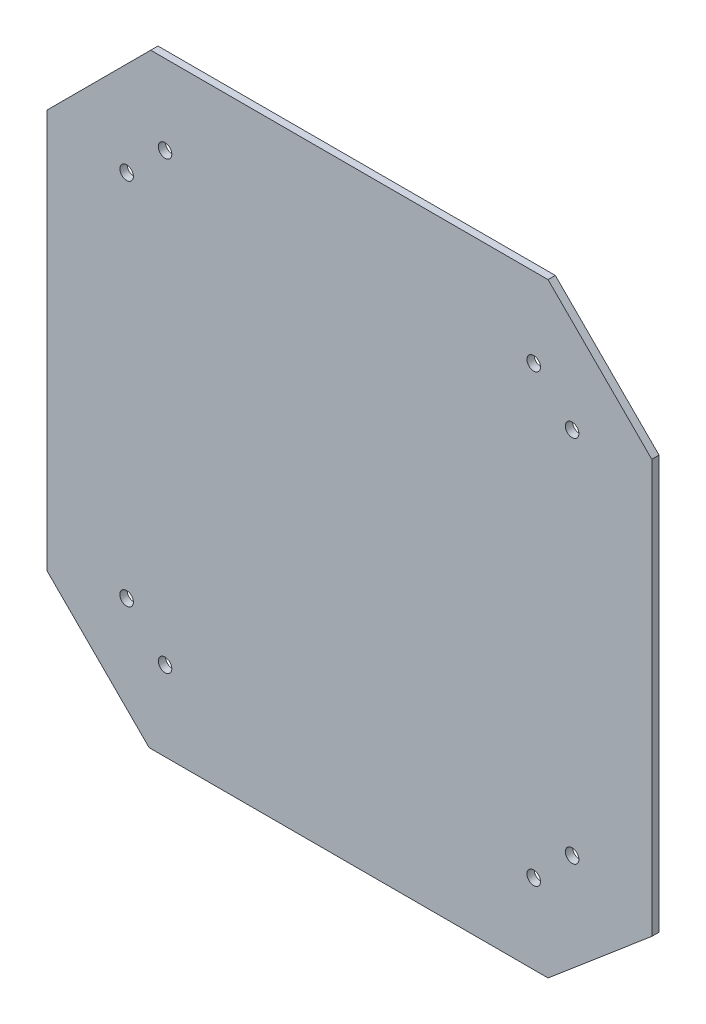
ISO-10303-21;
HEADER;
FILE_DESCRIPTION(('STEP AP214'),'2;1');
FILE_NAME('part.step','',(''),(''),'','','');
FILE_SCHEMA(('AUTOMOTIVE_DESIGN { 1 0 10303 214 1 1 1 1 }'));
ENDSEC;
DATA;
#1=APPLICATION_CONTEXT('core data for automotive mechanical design processes');
#2=APPLICATION_PROTOCOL_DEFINITION('international standard','automotive_design',2000,#1);
#3=PRODUCT_CONTEXT('',#1,'mechanical');
#4=PRODUCT('Part','Part','',(#3));
#5=PRODUCT_RELATED_PRODUCT_CATEGORY('part','',(#4));
#6=PRODUCT_DEFINITION_FORMATION('','',#4);
#7=PRODUCT_DEFINITION_CONTEXT('part definition',#1,'design');
#8=PRODUCT_DEFINITION('design','',#6,#7);
#9=PRODUCT_DEFINITION_SHAPE('','',#8);
#10=(LENGTH_UNIT() NAMED_UNIT(*) SI_UNIT(.MILLI.,.METRE.));
#11=(NAMED_UNIT(*) PLANE_ANGLE_UNIT() SI_UNIT($,.RADIAN.));
#12=(NAMED_UNIT(*) SI_UNIT($,.STERADIAN.) SOLID_ANGLE_UNIT());
#13=UNCERTAINTY_MEASURE_WITH_UNIT(LENGTH_MEASURE(1.E-05),#10,'distance_accuracy_value','');
#14=(GEOMETRIC_REPRESENTATION_CONTEXT(3) GLOBAL_UNCERTAINTY_ASSIGNED_CONTEXT((#13)) GLOBAL_UNIT_ASSIGNED_CONTEXT((#10,
#11,#12)) REPRESENTATION_CONTEXT('',''));
#15=CARTESIAN_POINT('',(0.,0.,0.));
#16=DIRECTION('',(0.,0.,1.));
#17=DIRECTION('',(1.,0.,0.));
#18=AXIS2_PLACEMENT_3D('',#15,#16,#17);
#19=CARTESIAN_POINT('',(62.5,-62.5,1.5));
#20=DIRECTION('',(0.,0.,-1.));
#21=DIRECTION('',(-1.,0.,0.));
#22=AXIS2_PLACEMENT_3D('',#19,#20,#21);
#23=PLANE('',#22);
#24=CARTESIAN_POINT('',(38.1,-46.0375,1.5));
#25=DIRECTION('',(0.,0.,1.));
#26=DIRECTION('',(1.,0.,0.));
#27=AXIS2_PLACEMENT_3D('',#24,#25,#26);
#28=CIRCLE('',#27,1.4);
#29=CARTESIAN_POINT('',(39.5,-46.0375,1.5));
#30=VERTEX_POINT('',#29);
#31=EDGE_CURVE('E174',#30,#30,#28,.T.);
#32=ORIENTED_EDGE('',*,*,#31,.F.);
#33=EDGE_LOOP('',(#32));
#34=FACE_BOUND('',#33,.T.);
#35=CARTESIAN_POINT('',(-46.0375,-38.1,1.5));
#36=DIRECTION('',(0.,0.,1.));
#37=DIRECTION('',(1.,0.,0.));
#38=AXIS2_PLACEMENT_3D('',#35,#36,#37);
#39=CIRCLE('',#38,1.4);
#40=CARTESIAN_POINT('',(-44.6375,-38.1,1.5));
#41=VERTEX_POINT('',#40);
#42=EDGE_CURVE('E186',#41,#41,#39,.T.);
#43=ORIENTED_EDGE('',*,*,#42,.F.);
#44=EDGE_LOOP('',(#43));
#45=FACE_BOUND('',#44,.T.);
#46=CARTESIAN_POINT('',(-38.1,46.0375,1.5));
#47=DIRECTION('',(0.,0.,1.));
#48=DIRECTION('',(1.,0.,0.));
#49=AXIS2_PLACEMENT_3D('',#46,#47,#48);
#50=CIRCLE('',#49,1.4);
#51=CARTESIAN_POINT('',(-36.7,46.0375,1.5));
#52=VERTEX_POINT('',#51);
#53=EDGE_CURVE('E198',#52,#52,#50,.T.);
#54=ORIENTED_EDGE('',*,*,#53,.F.);
#55=EDGE_LOOP('',(#54));
#56=FACE_BOUND('',#55,.T.);
#57=CARTESIAN_POINT('',(46.0375,38.1,1.5));
#58=DIRECTION('',(0.,0.,1.));
#59=DIRECTION('',(1.,0.,0.));
#60=AXIS2_PLACEMENT_3D('',#57,#58,#59);
#61=CIRCLE('',#60,1.4);
#62=CARTESIAN_POINT('',(47.4375,38.1,1.5));
#63=VERTEX_POINT('',#62);
#64=EDGE_CURVE('E123',#63,#63,#61,.T.);
#65=ORIENTED_EDGE('',*,*,#64,.F.);
#66=EDGE_LOOP('',(#65));
#67=FACE_BOUND('',#66,.T.);
#68=DIRECTION('',(-1.,0.,0.));
#69=VECTOR('',#68,1.);
#70=CARTESIAN_POINT('',(-62.5,62.5,1.5));
#71=LINE('',#70,#69);
#72=CARTESIAN_POINT('',(41.063122539474,62.5,1.5));
#73=VERTEX_POINT('',#72);
#74=CARTESIAN_POINT('',(-41.0631225394748,62.5,1.5));
#75=VERTEX_POINT('',#74);
#76=EDGE_CURVE('E105',#73,#75,#71,.T.);
#77=ORIENTED_EDGE('',*,*,#76,.T.);
#78=DIRECTION('',(0.707106781186543,0.707106781186552,0.));
#79=VECTOR('',#78,1.);
#80=CARTESIAN_POINT('',(-62.5,41.0631225394745,1.5));
#81=LINE('',#80,#79);
#82=CARTESIAN_POINT('',(-62.5,41.0631225394745,1.5));
#83=VERTEX_POINT('',#82);
#84=EDGE_CURVE('E97',#83,#75,#81,.T.);
#85=ORIENTED_EDGE('',*,*,#84,.F.);
#86=DIRECTION('',(0.,-1.,0.));
#87=VECTOR('',#86,1.);
#88=CARTESIAN_POINT('',(-62.5,62.5,1.5));
#89=LINE('',#88,#87);
#90=CARTESIAN_POINT('',(-62.5,-41.3841798011267,1.5));
#91=VERTEX_POINT('',#90);
#92=EDGE_CURVE('E55',#83,#91,#89,.T.);
#93=ORIENTED_EDGE('',*,*,#92,.T.);
#94=DIRECTION('',(-0.707106781186551,0.707106781186544,0.));
#95=VECTOR('',#94,1.);
#96=CARTESIAN_POINT('',(-41.3841798011264,-62.5,1.5));
#97=LINE('',#96,#95);
#98=CARTESIAN_POINT('',(-41.3841798011264,-62.5,1.5));
#99=VERTEX_POINT('',#98);
#100=EDGE_CURVE('E144',#99,#91,#97,.T.);
#101=ORIENTED_EDGE('',*,*,#100,.F.);
#102=DIRECTION('',(1.,0.,0.));
#103=VECTOR('',#102,1.);
#104=CARTESIAN_POINT('',(-62.5,-62.5,1.5));
#105=LINE('',#104,#103);
#106=CARTESIAN_POINT('',(41.063122539474,-62.5,1.5));
#107=VERTEX_POINT('',#106);
#108=EDGE_CURVE('E130',#99,#107,#105,.T.);
#109=ORIENTED_EDGE('',*,*,#108,.T.);
#110=DIRECTION('',(-0.76299079732098,-0.646409346469786,0.));
#111=VECTOR('',#110,1.);
#112=CARTESIAN_POINT('',(41.063122539474,-62.5,1.5));
#113=LINE('',#112,#111);
#114=CARTESIAN_POINT('',(62.5,-44.3385778724117,1.5));
#115=VERTEX_POINT('',#114);
#116=EDGE_CURVE('E159',#115,#107,#113,.T.);
#117=ORIENTED_EDGE('',*,*,#116,.F.);
#118=DIRECTION('',(0.,1.,0.));
#119=VECTOR('',#118,1.);
#120=CARTESIAN_POINT('',(62.5,62.5,1.5));
#121=LINE('',#120,#119);
#122=CARTESIAN_POINT('',(62.5,41.0631225394745,1.5));
#123=VERTEX_POINT('',#122);
#124=EDGE_CURVE('E116',#115,#123,#121,.T.);
#125=ORIENTED_EDGE('',*,*,#124,.T.);
#126=DIRECTION('',(0.707106781186556,-0.707106781186539,0.));
#127=VECTOR('',#126,1.);
#128=CARTESIAN_POINT('',(41.063122539474,62.5,1.5));
#129=LINE('',#128,#127);
#130=EDGE_CURVE('E153',#73,#123,#129,.T.);
#131=ORIENTED_EDGE('',*,*,#130,.F.);
#132=EDGE_LOOP('',(#77,#85,#93,#101,#109,#117,#125,#131));
#133=FACE_BOUND('',#132,.T.);
#134=CARTESIAN_POINT('',(38.1,46.0375,1.5));
#135=DIRECTION('',(0.,0.,1.));
#136=DIRECTION('',(1.,0.,0.));
#137=AXIS2_PLACEMENT_3D('',#134,#135,#136);
#138=CIRCLE('',#137,1.4);
#139=CARTESIAN_POINT('',(39.5,46.0375,1.5));
#140=VERTEX_POINT('',#139);
#141=EDGE_CURVE('E204',#140,#140,#138,.T.);
#142=ORIENTED_EDGE('',*,*,#141,.F.);
#143=EDGE_LOOP('',(#142));
#144=FACE_BOUND('',#143,.T.);
#145=CARTESIAN_POINT('',(-46.0375,38.1,1.5));
#146=DIRECTION('',(0.,0.,1.));
#147=DIRECTION('',(1.,0.,0.));
#148=AXIS2_PLACEMENT_3D('',#145,#146,#147);
#149=CIRCLE('',#148,1.4);
#150=CARTESIAN_POINT('',(-44.6375,38.1,1.5));
#151=VERTEX_POINT('',#150);
#152=EDGE_CURVE('E192',#151,#151,#149,.T.);
#153=ORIENTED_EDGE('',*,*,#152,.F.);
#154=EDGE_LOOP('',(#153));
#155=FACE_BOUND('',#154,.T.);
#156=CARTESIAN_POINT('',(-38.1,-46.0375,1.5));
#157=DIRECTION('',(0.,0.,1.));
#158=DIRECTION('',(1.,0.,0.));
#159=AXIS2_PLACEMENT_3D('',#156,#157,#158);
#160=CIRCLE('',#159,1.4);
#161=CARTESIAN_POINT('',(-36.7,-46.0375,1.5));
#162=VERTEX_POINT('',#161);
#163=EDGE_CURVE('E180',#162,#162,#160,.T.);
#164=ORIENTED_EDGE('',*,*,#163,.F.);
#165=EDGE_LOOP('',(#164));
#166=FACE_BOUND('',#165,.T.);
#167=CARTESIAN_POINT('',(46.0375,-38.1,1.5));
#168=DIRECTION('',(0.,0.,1.));
#169=DIRECTION('',(1.,0.,0.));
#170=AXIS2_PLACEMENT_3D('',#167,#168,#169);
#171=CIRCLE('',#170,1.4);
#172=CARTESIAN_POINT('',(47.4375,-38.1,1.5));
#173=VERTEX_POINT('',#172);
#174=EDGE_CURVE('E168',#173,#173,#171,.T.);
#175=ORIENTED_EDGE('',*,*,#174,.F.);
#176=EDGE_LOOP('',(#175));
#177=FACE_BOUND('',#176,.T.);
#178=ADVANCED_FACE('F33',(#34,#45,#56,#67,#133,#144,#155,#166,#177),#23,.F.);
#179=CARTESIAN_POINT('',(62.5,-62.5,0.));
#180=DIRECTION('',(0.,0.,-1.));
#181=DIRECTION('',(-1.,0.,0.));
#182=AXIS2_PLACEMENT_3D('',#179,#180,#181);
#183=PLANE('',#182);
#184=DIRECTION('',(-0.707106781186543,-0.707106781186552,0.));
#185=VECTOR('',#184,1.);
#186=CARTESIAN_POINT('',(-51.7815612697381,51.7815612697366,0.));
#187=LINE('',#186,#185);
#188=CARTESIAN_POINT('',(-41.0631225394748,62.5,0.));
#189=VERTEX_POINT('',#188);
#190=CARTESIAN_POINT('',(-62.5,41.0631225394745,0.));
#191=VERTEX_POINT('',#190);
#192=EDGE_CURVE('E48',#189,#191,#187,.T.);
#193=ORIENTED_EDGE('',*,*,#192,.F.);
#194=DIRECTION('',(-1.,0.,0.));
#195=VECTOR('',#194,1.);
#196=CARTESIAN_POINT('',(-62.5,62.5,0.));
#197=LINE('',#196,#195);
#198=CARTESIAN_POINT('',(41.063122539474,62.5,0.));
#199=VERTEX_POINT('',#198);
#200=EDGE_CURVE('E126',#199,#189,#197,.T.);
#201=ORIENTED_EDGE('',*,*,#200,.F.);
#202=DIRECTION('',(-0.707106781186556,0.707106781186539,0.));
#203=VECTOR('',#202,1.);
#204=CARTESIAN_POINT('',(114.281561269737,-10.7184387302615,0.));
#205=LINE('',#204,#203);
#206=CARTESIAN_POINT('',(62.5,41.0631225394745,0.));
#207=VERTEX_POINT('',#206);
#208=EDGE_CURVE('E142',#207,#199,#205,.T.);
#209=ORIENTED_EDGE('',*,*,#208,.F.);
#210=DIRECTION('',(0.,1.,0.));
#211=VECTOR('',#210,1.);
#212=CARTESIAN_POINT('',(62.5,62.5,0.));
#213=LINE('',#212,#211);
#214=CARTESIAN_POINT('',(62.5,-44.3385778724117,0.));
#215=VERTEX_POINT('',#214);
#216=EDGE_CURVE('E122',#215,#207,#213,.T.);
#217=ORIENTED_EDGE('',*,*,#216,.F.);
#218=DIRECTION('',(0.76299079732098,0.646409346469786,0.));
#219=VECTOR('',#218,1.);
#220=CARTESIAN_POINT('',(53.5427070113585,-51.9272380859508,0.));
#221=LINE('',#220,#219);
#222=CARTESIAN_POINT('',(41.063122539474,-62.5,0.));
#223=VERTEX_POINT('',#222);
#224=EDGE_CURVE('E165',#223,#215,#221,.T.);
#225=ORIENTED_EDGE('',*,*,#224,.F.);
#226=DIRECTION('',(1.,0.,0.));
#227=VECTOR('',#226,1.);
#228=CARTESIAN_POINT('',(-62.5,-62.5,0.));
#229=LINE('',#228,#227);
#230=CARTESIAN_POINT('',(-41.3841798011264,-62.5,0.));
#231=VERTEX_POINT('',#230);
#232=EDGE_CURVE('E120',#231,#223,#229,.T.);
#233=ORIENTED_EDGE('',*,*,#232,.F.);
#234=DIRECTION('',(0.707106781186551,-0.707106781186544,0.));
#235=VECTOR('',#234,1.);
#236=CARTESIAN_POINT('',(10.5579100994373,-114.442089900563,0.));
#237=LINE('',#236,#235);
#238=CARTESIAN_POINT('',(-62.5,-41.3841798011267,0.));
#239=VERTEX_POINT('',#238);
#240=EDGE_CURVE('E151',#239,#231,#237,.T.);
#241=ORIENTED_EDGE('',*,*,#240,.F.);
#242=DIRECTION('',(0.,-1.,0.));
#243=VECTOR('',#242,1.);
#244=CARTESIAN_POINT('',(-62.5,62.5,0.));
#245=LINE('',#244,#243);
#246=EDGE_CURVE('E129',#191,#239,#245,.T.);
#247=ORIENTED_EDGE('',*,*,#246,.F.);
#248=EDGE_LOOP('',(#193,#201,#209,#217,#225,#233,#241,#247));
#249=FACE_BOUND('',#248,.T.);
#250=CARTESIAN_POINT('',(38.1,-46.0375,0.));
#251=DIRECTION('',(0.,0.,1.));
#252=DIRECTION('',(1.,0.,0.));
#253=AXIS2_PLACEMENT_3D('',#250,#251,#252);
#254=CIRCLE('',#253,1.4);
#255=CARTESIAN_POINT('',(39.5,-46.0375,0.));
#256=VERTEX_POINT('',#255);
#257=EDGE_CURVE('E171',#256,#256,#254,.T.);
#258=ORIENTED_EDGE('',*,*,#257,.T.);
#259=EDGE_LOOP('',(#258));
#260=FACE_BOUND('',#259,.T.);
#261=CARTESIAN_POINT('',(-46.0375,-38.1,0.));
#262=DIRECTION('',(0.,0.,1.));
#263=DIRECTION('',(1.,0.,0.));
#264=AXIS2_PLACEMENT_3D('',#261,#262,#263);
#265=CIRCLE('',#264,1.4);
#266=CARTESIAN_POINT('',(-44.6375,-38.1,0.));
#267=VERTEX_POINT('',#266);
#268=EDGE_CURVE('E183',#267,#267,#265,.T.);
#269=ORIENTED_EDGE('',*,*,#268,.T.);
#270=EDGE_LOOP('',(#269));
#271=FACE_BOUND('',#270,.T.);
#272=CARTESIAN_POINT('',(-38.1,46.0375,0.));
#273=DIRECTION('',(0.,0.,1.));
#274=DIRECTION('',(1.,0.,0.));
#275=AXIS2_PLACEMENT_3D('',#272,#273,#274);
#276=CIRCLE('',#275,1.4);
#277=CARTESIAN_POINT('',(-36.7,46.0375,0.));
#278=VERTEX_POINT('',#277);
#279=EDGE_CURVE('E195',#278,#278,#276,.T.);
#280=ORIENTED_EDGE('',*,*,#279,.T.);
#281=EDGE_LOOP('',(#280));
#282=FACE_BOUND('',#281,.T.);
#283=CARTESIAN_POINT('',(46.0375,38.1,0.));
#284=DIRECTION('',(0.,0.,1.));
#285=DIRECTION('',(1.,0.,0.));
#286=AXIS2_PLACEMENT_3D('',#283,#284,#285);
#287=CIRCLE('',#286,1.4);
#288=CARTESIAN_POINT('',(47.4375,38.1,0.));
#289=VERTEX_POINT('',#288);
#290=EDGE_CURVE('E207',#289,#289,#287,.T.);
#291=ORIENTED_EDGE('',*,*,#290,.T.);
#292=EDGE_LOOP('',(#291));
#293=FACE_BOUND('',#292,.T.);
#294=CARTESIAN_POINT('',(38.1,46.0375,0.));
#295=DIRECTION('',(0.,0.,1.));
#296=DIRECTION('',(1.,0.,0.));
#297=AXIS2_PLACEMENT_3D('',#294,#295,#296);
#298=CIRCLE('',#297,1.4);
#299=CARTESIAN_POINT('',(39.5,46.0375,0.));
#300=VERTEX_POINT('',#299);
#301=EDGE_CURVE('E201',#300,#300,#298,.T.);
#302=ORIENTED_EDGE('',*,*,#301,.T.);
#303=EDGE_LOOP('',(#302));
#304=FACE_BOUND('',#303,.T.);
#305=CARTESIAN_POINT('',(-46.0375,38.1,0.));
#306=DIRECTION('',(0.,0.,1.));
#307=DIRECTION('',(1.,0.,0.));
#308=AXIS2_PLACEMENT_3D('',#305,#306,#307);
#309=CIRCLE('',#308,1.4);
#310=CARTESIAN_POINT('',(-44.6375,38.1,0.));
#311=VERTEX_POINT('',#310);
#312=EDGE_CURVE('E189',#311,#311,#309,.T.);
#313=ORIENTED_EDGE('',*,*,#312,.T.);
#314=EDGE_LOOP('',(#313));
#315=FACE_BOUND('',#314,.T.);
#316=CARTESIAN_POINT('',(-38.1,-46.0375,0.));
#317=DIRECTION('',(0.,0.,1.));
#318=DIRECTION('',(1.,0.,0.));
#319=AXIS2_PLACEMENT_3D('',#316,#317,#318);
#320=CIRCLE('',#319,1.4);
#321=CARTESIAN_POINT('',(-36.7,-46.0375,0.));
#322=VERTEX_POINT('',#321);
#323=EDGE_CURVE('E177',#322,#322,#320,.T.);
#324=ORIENTED_EDGE('',*,*,#323,.T.);
#325=EDGE_LOOP('',(#324));
#326=FACE_BOUND('',#325,.T.);
#327=CARTESIAN_POINT('',(46.0375,-38.1,0.));
#328=DIRECTION('',(0.,0.,1.));
#329=DIRECTION('',(1.,0.,0.));
#330=AXIS2_PLACEMENT_3D('',#327,#328,#329);
#331=CIRCLE('',#330,1.4);
#332=CARTESIAN_POINT('',(47.4375,-38.1,0.));
#333=VERTEX_POINT('',#332);
#334=EDGE_CURVE('E167',#333,#333,#331,.T.);
#335=ORIENTED_EDGE('',*,*,#334,.T.);
#336=EDGE_LOOP('',(#335));
#337=FACE_BOUND('',#336,.T.);
#338=ADVANCED_FACE('F139',(#249,#260,#271,#282,#293,#304,#315,#326,#337),#183,.T.);
#339=CARTESIAN_POINT('',(-62.5,-62.5,1.5));
#340=DIRECTION('',(0.,1.,0.));
#341=DIRECTION('',(0.,0.,1.));
#342=AXIS2_PLACEMENT_3D('',#339,#340,#341);
#343=PLANE('',#342);
#344=ORIENTED_EDGE('',*,*,#108,.F.);
#345=DIRECTION('',(0.,0.,1.));
#346=VECTOR('',#345,1.);
#347=CARTESIAN_POINT('',(-41.3841798011264,-62.5,-8.5));
#348=LINE('',#347,#346);
#349=EDGE_CURVE('E146',#231,#99,#348,.T.);
#350=ORIENTED_EDGE('',*,*,#349,.F.);
#351=ORIENTED_EDGE('',*,*,#232,.T.);
#352=DIRECTION('',(0.,0.,1.));
#353=VECTOR('',#352,1.);
#354=CARTESIAN_POINT('',(41.063122539474,-62.5,-8.5));
#355=LINE('',#354,#353);
#356=EDGE_CURVE('E162',#223,#107,#355,.T.);
#357=ORIENTED_EDGE('',*,*,#356,.T.);
#358=EDGE_LOOP('',(#344,#350,#351,#357));
#359=FACE_BOUND('',#358,.T.);
#360=ADVANCED_FACE('F35',(#359),#343,.F.);
#361=CARTESIAN_POINT('',(62.5,62.5,1.5));
#362=DIRECTION('',(-1.,0.,0.));
#363=DIRECTION('',(0.,-1.,0.));
#364=AXIS2_PLACEMENT_3D('',#361,#362,#363);
#365=PLANE('',#364);
#366=ORIENTED_EDGE('',*,*,#216,.T.);
#367=DIRECTION('',(0.,0.,1.));
#368=VECTOR('',#367,1.);
#369=CARTESIAN_POINT('',(62.5,41.0631225394745,-8.5));
#370=LINE('',#369,#368);
#371=EDGE_CURVE('E155',#207,#123,#370,.T.);
#372=ORIENTED_EDGE('',*,*,#371,.T.);
#373=ORIENTED_EDGE('',*,*,#124,.F.);
#374=DIRECTION('',(0.,0.,-1.));
#375=VECTOR('',#374,1.);
#376=CARTESIAN_POINT('',(62.5,-44.3385778724117,1.5));
#377=LINE('',#376,#375);
#378=EDGE_CURVE('E111',#115,#215,#377,.T.);
#379=ORIENTED_EDGE('',*,*,#378,.T.);
#380=EDGE_LOOP('',(#366,#372,#373,#379));
#381=FACE_BOUND('',#380,.T.);
#382=ADVANCED_FACE('F218',(#381),#365,.F.);
#383=CARTESIAN_POINT('',(-62.5,62.5,1.5));
#384=DIRECTION('',(0.,-1.,0.));
#385=DIRECTION('',(1.,0.,0.));
#386=AXIS2_PLACEMENT_3D('',#383,#384,#385);
#387=PLANE('',#386);
#388=ORIENTED_EDGE('',*,*,#200,.T.);
#389=DIRECTION('',(0.,0.,1.));
#390=VECTOR('',#389,1.);
#391=CARTESIAN_POINT('',(-41.0631225394748,62.5,-8.5));
#392=LINE('',#391,#390);
#393=EDGE_CURVE('E106',#189,#75,#392,.T.);
#394=ORIENTED_EDGE('',*,*,#393,.T.);
#395=ORIENTED_EDGE('',*,*,#76,.F.);
#396=DIRECTION('',(0.,0.,-1.));
#397=VECTOR('',#396,1.);
#398=CARTESIAN_POINT('',(41.063122539474,62.5,1.5));
#399=LINE('',#398,#397);
#400=EDGE_CURVE('E114',#73,#199,#399,.T.);
#401=ORIENTED_EDGE('',*,*,#400,.T.);
#402=EDGE_LOOP('',(#388,#394,#395,#401));
#403=FACE_BOUND('',#402,.T.);
#404=ADVANCED_FACE('F135',(#403),#387,.F.);
#405=CARTESIAN_POINT('',(-62.5,62.5,1.5));
#406=DIRECTION('',(1.,0.,0.));
#407=DIRECTION('',(0.,1.,0.));
#408=AXIS2_PLACEMENT_3D('',#405,#406,#407);
#409=PLANE('',#408);
#410=ORIENTED_EDGE('',*,*,#92,.F.);
#411=DIRECTION('',(0.,0.,-1.));
#412=VECTOR('',#411,1.);
#413=CARTESIAN_POINT('',(-62.5,41.0631225394745,1.5));
#414=LINE('',#413,#412);
#415=EDGE_CURVE('E11',#83,#191,#414,.T.);
#416=ORIENTED_EDGE('',*,*,#415,.T.);
#417=ORIENTED_EDGE('',*,*,#246,.T.);
#418=DIRECTION('',(0.,0.,1.));
#419=VECTOR('',#418,1.);
#420=CARTESIAN_POINT('',(-62.5,-41.3841798011267,1.5));
#421=LINE('',#420,#419);
#422=EDGE_CURVE('E41',#239,#91,#421,.T.);
#423=ORIENTED_EDGE('',*,*,#422,.T.);
#424=EDGE_LOOP('',(#410,#416,#417,#423));
#425=FACE_BOUND('',#424,.T.);
#426=ADVANCED_FACE('F109',(#425),#409,.F.);
#427=CARTESIAN_POINT('',(46.0375,38.1,1.5));
#428=DIRECTION('',(0.,0.,-1.));
#429=DIRECTION('',(-1.,0.,0.));
#430=AXIS2_PLACEMENT_3D('',#427,#428,#429);
#431=CYLINDRICAL_SURFACE('',#430,1.4);
#432=ORIENTED_EDGE('',*,*,#64,.T.);
#433=EDGE_LOOP('',(#432));
#434=FACE_BOUND('',#433,.T.);
#435=ORIENTED_EDGE('',*,*,#290,.F.);
#436=EDGE_LOOP('',(#435));
#437=FACE_BOUND('',#436,.T.);
#438=ADVANCED_FACE('F243',(#434,#437),#431,.F.);
#439=CARTESIAN_POINT('',(38.1,46.0375,1.5));
#440=DIRECTION('',(0.,0.,-1.));
#441=DIRECTION('',(-1.,0.,0.));
#442=AXIS2_PLACEMENT_3D('',#439,#440,#441);
#443=CYLINDRICAL_SURFACE('',#442,1.4);
#444=ORIENTED_EDGE('',*,*,#141,.T.);
#445=EDGE_LOOP('',(#444));
#446=FACE_BOUND('',#445,.T.);
#447=ORIENTED_EDGE('',*,*,#301,.F.);
#448=EDGE_LOOP('',(#447));
#449=FACE_BOUND('',#448,.T.);
#450=ADVANCED_FACE('F329',(#446,#449),#443,.F.);
#451=CARTESIAN_POINT('',(-38.1,46.0375,1.5));
#452=DIRECTION('',(0.,0.,-1.));
#453=DIRECTION('',(-1.,0.,0.));
#454=AXIS2_PLACEMENT_3D('',#451,#452,#453);
#455=CYLINDRICAL_SURFACE('',#454,1.4);
#456=ORIENTED_EDGE('',*,*,#53,.T.);
#457=EDGE_LOOP('',(#456));
#458=FACE_BOUND('',#457,.T.);
#459=ORIENTED_EDGE('',*,*,#279,.F.);
#460=EDGE_LOOP('',(#459));
#461=FACE_BOUND('',#460,.T.);
#462=ADVANCED_FACE('F319',(#458,#461),#455,.F.);
#463=CARTESIAN_POINT('',(-46.0375,38.1,1.5));
#464=DIRECTION('',(0.,0.,-1.));
#465=DIRECTION('',(-1.,0.,0.));
#466=AXIS2_PLACEMENT_3D('',#463,#464,#465);
#467=CYLINDRICAL_SURFACE('',#466,1.4);
#468=ORIENTED_EDGE('',*,*,#152,.T.);
#469=EDGE_LOOP('',(#468));
#470=FACE_BOUND('',#469,.T.);
#471=ORIENTED_EDGE('',*,*,#312,.F.);
#472=EDGE_LOOP('',(#471));
#473=FACE_BOUND('',#472,.T.);
#474=ADVANCED_FACE('F309',(#470,#473),#467,.F.);
#475=CARTESIAN_POINT('',(-46.0375,-38.1,1.5));
#476=DIRECTION('',(0.,0.,-1.));
#477=DIRECTION('',(-1.,0.,0.));
#478=AXIS2_PLACEMENT_3D('',#475,#476,#477);
#479=CYLINDRICAL_SURFACE('',#478,1.4);
#480=ORIENTED_EDGE('',*,*,#42,.T.);
#481=EDGE_LOOP('',(#480));
#482=FACE_BOUND('',#481,.T.);
#483=ORIENTED_EDGE('',*,*,#268,.F.);
#484=EDGE_LOOP('',(#483));
#485=FACE_BOUND('',#484,.T.);
#486=ADVANCED_FACE('F299',(#482,#485),#479,.F.);
#487=CARTESIAN_POINT('',(-38.1,-46.0375,1.5));
#488=DIRECTION('',(0.,0.,-1.));
#489=DIRECTION('',(-1.,0.,0.));
#490=AXIS2_PLACEMENT_3D('',#487,#488,#489);
#491=CYLINDRICAL_SURFACE('',#490,1.4);
#492=ORIENTED_EDGE('',*,*,#163,.T.);
#493=EDGE_LOOP('',(#492));
#494=FACE_BOUND('',#493,.T.);
#495=ORIENTED_EDGE('',*,*,#323,.F.);
#496=EDGE_LOOP('',(#495));
#497=FACE_BOUND('',#496,.T.);
#498=ADVANCED_FACE('F289',(#494,#497),#491,.F.);
#499=CARTESIAN_POINT('',(38.1,-46.0375,1.5));
#500=DIRECTION('',(0.,0.,-1.));
#501=DIRECTION('',(-1.,0.,0.));
#502=AXIS2_PLACEMENT_3D('',#499,#500,#501);
#503=CYLINDRICAL_SURFACE('',#502,1.4);
#504=ORIENTED_EDGE('',*,*,#31,.T.);
#505=EDGE_LOOP('',(#504));
#506=FACE_BOUND('',#505,.T.);
#507=ORIENTED_EDGE('',*,*,#257,.F.);
#508=EDGE_LOOP('',(#507));
#509=FACE_BOUND('',#508,.T.);
#510=ADVANCED_FACE('F278',(#506,#509),#503,.F.);
#511=CARTESIAN_POINT('',(46.0375,-38.1,1.5));
#512=DIRECTION('',(0.,0.,-1.));
#513=DIRECTION('',(-1.,0.,0.));
#514=AXIS2_PLACEMENT_3D('',#511,#512,#513);
#515=CYLINDRICAL_SURFACE('',#514,1.4);
#516=ORIENTED_EDGE('',*,*,#174,.T.);
#517=EDGE_LOOP('',(#516));
#518=FACE_BOUND('',#517,.T.);
#519=ORIENTED_EDGE('',*,*,#334,.F.);
#520=EDGE_LOOP('',(#519));
#521=FACE_BOUND('',#520,.T.);
#522=ADVANCED_FACE('F230',(#518,#521),#515,.F.);
#523=CARTESIAN_POINT('',(41.063122539474,-62.5,-8.5));
#524=DIRECTION('',(-0.646409346469786,0.76299079732098,0.));
#525=DIRECTION('',(-0.76299079732098,-0.646409346469786,0.));
#526=AXIS2_PLACEMENT_3D('',#523,#524,#525);
#527=PLANE('',#526);
#528=ORIENTED_EDGE('',*,*,#224,.T.);
#529=ORIENTED_EDGE('',*,*,#378,.F.);
#530=ORIENTED_EDGE('',*,*,#116,.T.);
#531=ORIENTED_EDGE('',*,*,#356,.F.);
#532=EDGE_LOOP('',(#528,#529,#530,#531));
#533=FACE_BOUND('',#532,.T.);
#534=ADVANCED_FACE('F222',(#533),#527,.F.);
#535=CARTESIAN_POINT('',(41.063122539474,62.5,-8.5));
#536=DIRECTION('',(-0.707106781186539,-0.707106781186556,0.));
#537=DIRECTION('',(0.707106781186556,-0.707106781186539,0.));
#538=AXIS2_PLACEMENT_3D('',#535,#536,#537);
#539=PLANE('',#538);
#540=ORIENTED_EDGE('',*,*,#208,.T.);
#541=ORIENTED_EDGE('',*,*,#400,.F.);
#542=ORIENTED_EDGE('',*,*,#130,.T.);
#543=ORIENTED_EDGE('',*,*,#371,.F.);
#544=EDGE_LOOP('',(#540,#541,#542,#543));
#545=FACE_BOUND('',#544,.T.);
#546=ADVANCED_FACE('F219',(#545),#539,.F.);
#547=CARTESIAN_POINT('',(-41.3841798011264,-62.5,-8.5));
#548=DIRECTION('',(0.707106781186544,0.707106781186551,0.));
#549=DIRECTION('',(-0.707106781186551,0.707106781186544,0.));
#550=AXIS2_PLACEMENT_3D('',#547,#548,#549);
#551=PLANE('',#550);
#552=ORIENTED_EDGE('',*,*,#240,.T.);
#553=ORIENTED_EDGE('',*,*,#349,.T.);
#554=ORIENTED_EDGE('',*,*,#100,.T.);
#555=ORIENTED_EDGE('',*,*,#422,.F.);
#556=EDGE_LOOP('',(#552,#553,#554,#555));
#557=FACE_BOUND('',#556,.T.);
#558=ADVANCED_FACE('F221',(#557),#551,.F.);
#559=CARTESIAN_POINT('',(-62.5,41.0631225394745,-8.5));
#560=DIRECTION('',(0.707106781186552,-0.707106781186543,0.));
#561=DIRECTION('',(0.707106781186543,0.707106781186552,0.));
#562=AXIS2_PLACEMENT_3D('',#559,#560,#561);
#563=PLANE('',#562);
#564=ORIENTED_EDGE('',*,*,#192,.T.);
#565=ORIENTED_EDGE('',*,*,#415,.F.);
#566=ORIENTED_EDGE('',*,*,#84,.T.);
#567=ORIENTED_EDGE('',*,*,#393,.F.);
#568=EDGE_LOOP('',(#564,#565,#566,#567));
#569=FACE_BOUND('',#568,.T.);
#570=ADVANCED_FACE('F96',(#569),#563,.F.);
#571=CLOSED_SHELL('',(#178,#338,#360,#382,#404,#426,#438,#450,#462,#474,#486,#498,#510,#522,
#534,#546,#558,#570));
#572=MANIFOLD_SOLID_BREP('B2',#571);
#573=ADVANCED_BREP_SHAPE_REPRESENTATION('',(#18,#572),#14);
#574=SHAPE_DEFINITION_REPRESENTATION(#9,#573);
ENDSEC;
END-ISO-10303-21;
